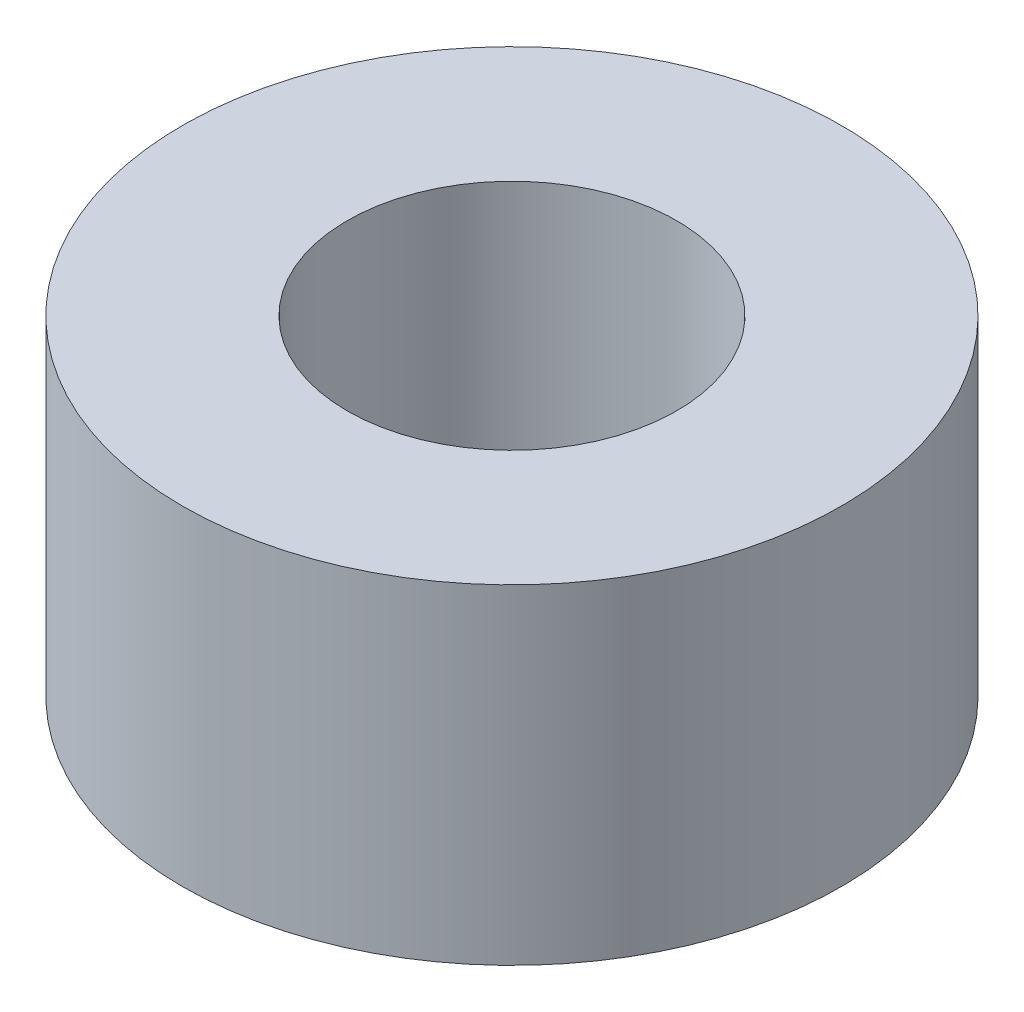
ISO-10303-21;
HEADER;
FILE_DESCRIPTION(('STEP AP214'),'2;1');
FILE_NAME('part.step','',(''),(''),'','','');
FILE_SCHEMA(('AUTOMOTIVE_DESIGN { 1 0 10303 214 1 1 1 1 }'));
ENDSEC;
DATA;
#1=APPLICATION_CONTEXT('core data for automotive mechanical design processes');
#2=APPLICATION_PROTOCOL_DEFINITION('international standard','automotive_design',2000,#1);
#3=PRODUCT_CONTEXT('',#1,'mechanical');
#4=PRODUCT('Part','Part','',(#3));
#5=PRODUCT_RELATED_PRODUCT_CATEGORY('part','',(#4));
#6=PRODUCT_DEFINITION_FORMATION('','',#4);
#7=PRODUCT_DEFINITION_CONTEXT('part definition',#1,'design');
#8=PRODUCT_DEFINITION('design','',#6,#7);
#9=PRODUCT_DEFINITION_SHAPE('','',#8);
#10=(LENGTH_UNIT() NAMED_UNIT(*) SI_UNIT(.MILLI.,.METRE.));
#11=(NAMED_UNIT(*) PLANE_ANGLE_UNIT() SI_UNIT($,.RADIAN.));
#12=(NAMED_UNIT(*) SI_UNIT($,.STERADIAN.) SOLID_ANGLE_UNIT());
#13=UNCERTAINTY_MEASURE_WITH_UNIT(LENGTH_MEASURE(1.E-05),#10,'distance_accuracy_value','');
#14=(GEOMETRIC_REPRESENTATION_CONTEXT(3) GLOBAL_UNCERTAINTY_ASSIGNED_CONTEXT((#13)) GLOBAL_UNIT_ASSIGNED_CONTEXT((#10,
#11,#12)) REPRESENTATION_CONTEXT('',''));
#15=CARTESIAN_POINT('',(0.,0.,0.));
#16=DIRECTION('',(0.,0.,1.));
#17=DIRECTION('',(1.,0.,0.));
#18=AXIS2_PLACEMENT_3D('',#15,#16,#17);
#19=CARTESIAN_POINT('',(0.,6.35,0.));
#20=DIRECTION('',(0.,-1.,0.));
#21=DIRECTION('',(0.,0.,-1.));
#22=AXIS2_PLACEMENT_3D('',#19,#20,#21);
#23=CYLINDRICAL_SURFACE('',#22,6.35);
#24=CARTESIAN_POINT('',(0.,6.35,0.));
#25=DIRECTION('',(0.,1.,0.));
#26=DIRECTION('',(0.,0.,1.));
#27=AXIS2_PLACEMENT_3D('',#24,#25,#26);
#28=CIRCLE('',#27,6.35);
#29=CARTESIAN_POINT('',(0.,6.35,6.35));
#30=VERTEX_POINT('',#29);
#31=EDGE_CURVE('E10',#30,#30,#28,.T.);
#32=ORIENTED_EDGE('',*,*,#31,.F.);
#33=EDGE_LOOP('',(#32));
#34=FACE_BOUND('',#33,.T.);
#35=CARTESIAN_POINT('',(0.,0.,0.));
#36=DIRECTION('',(0.,1.,0.));
#37=DIRECTION('',(0.,0.,1.));
#38=AXIS2_PLACEMENT_3D('',#35,#36,#37);
#39=CIRCLE('',#38,6.35);
#40=CARTESIAN_POINT('',(0.,0.,6.35));
#41=VERTEX_POINT('',#40);
#42=EDGE_CURVE('E38',#41,#41,#39,.T.);
#43=ORIENTED_EDGE('',*,*,#42,.T.);
#44=EDGE_LOOP('',(#43));
#45=FACE_BOUND('',#44,.T.);
#46=ADVANCED_FACE('F35',(#34,#45),#23,.T.);
#47=CARTESIAN_POINT('',(0.,6.35,0.));
#48=DIRECTION('',(0.,1.,0.));
#49=DIRECTION('',(0.,0.,1.));
#50=AXIS2_PLACEMENT_3D('',#47,#48,#49);
#51=PLANE('',#50);
#52=CARTESIAN_POINT('',(0.,6.35,0.));
#53=DIRECTION('',(0.,1.,0.));
#54=DIRECTION('',(0.,0.,1.));
#55=AXIS2_PLACEMENT_3D('',#52,#53,#54);
#56=CIRCLE('',#55,3.175);
#57=CARTESIAN_POINT('',(0.,6.35,3.175));
#58=VERTEX_POINT('',#57);
#59=EDGE_CURVE('E49',#58,#58,#56,.T.);
#60=ORIENTED_EDGE('',*,*,#59,.F.);
#61=EDGE_LOOP('',(#60));
#62=FACE_BOUND('',#61,.T.);
#63=ORIENTED_EDGE('',*,*,#31,.T.);
#64=EDGE_LOOP('',(#63));
#65=FACE_BOUND('',#64,.T.);
#66=ADVANCED_FACE('F55',(#62,#65),#51,.T.);
#67=CARTESIAN_POINT('',(0.,0.,0.));
#68=DIRECTION('',(0.,1.,0.));
#69=DIRECTION('',(0.,0.,1.));
#70=AXIS2_PLACEMENT_3D('',#67,#68,#69);
#71=PLANE('',#70);
#72=CARTESIAN_POINT('',(0.,0.,0.));
#73=DIRECTION('',(0.,1.,0.));
#74=DIRECTION('',(0.,0.,1.));
#75=AXIS2_PLACEMENT_3D('',#72,#73,#74);
#76=CIRCLE('',#75,3.175);
#77=CARTESIAN_POINT('',(0.,0.,3.175));
#78=VERTEX_POINT('',#77);
#79=EDGE_CURVE('E45',#78,#78,#76,.T.);
#80=ORIENTED_EDGE('',*,*,#79,.T.);
#81=EDGE_LOOP('',(#80));
#82=FACE_BOUND('',#81,.T.);
#83=ORIENTED_EDGE('',*,*,#42,.F.);
#84=EDGE_LOOP('',(#83));
#85=FACE_BOUND('',#84,.T.);
#86=ADVANCED_FACE('F57',(#82,#85),#71,.F.);
#87=CARTESIAN_POINT('',(0.,6.35,0.));
#88=DIRECTION('',(0.,1.,0.));
#89=DIRECTION('',(0.,0.,1.));
#90=AXIS2_PLACEMENT_3D('',#87,#88,#89);
#91=CYLINDRICAL_SURFACE('',#90,3.175);
#92=ORIENTED_EDGE('',*,*,#79,.F.);
#93=EDGE_LOOP('',(#92));
#94=FACE_BOUND('',#93,.T.);
#95=ORIENTED_EDGE('',*,*,#59,.T.);
#96=EDGE_LOOP('',(#95));
#97=FACE_BOUND('',#96,.T.);
#98=ADVANCED_FACE('F53',(#94,#97),#91,.F.);
#99=CLOSED_SHELL('',(#46,#66,#86,#98));
#100=MANIFOLD_SOLID_BREP('B2',#99);
#101=ADVANCED_BREP_SHAPE_REPRESENTATION('',(#18,#100),#14);
#102=SHAPE_DEFINITION_REPRESENTATION(#9,#101);
ENDSEC;
END-ISO-10303-21;
